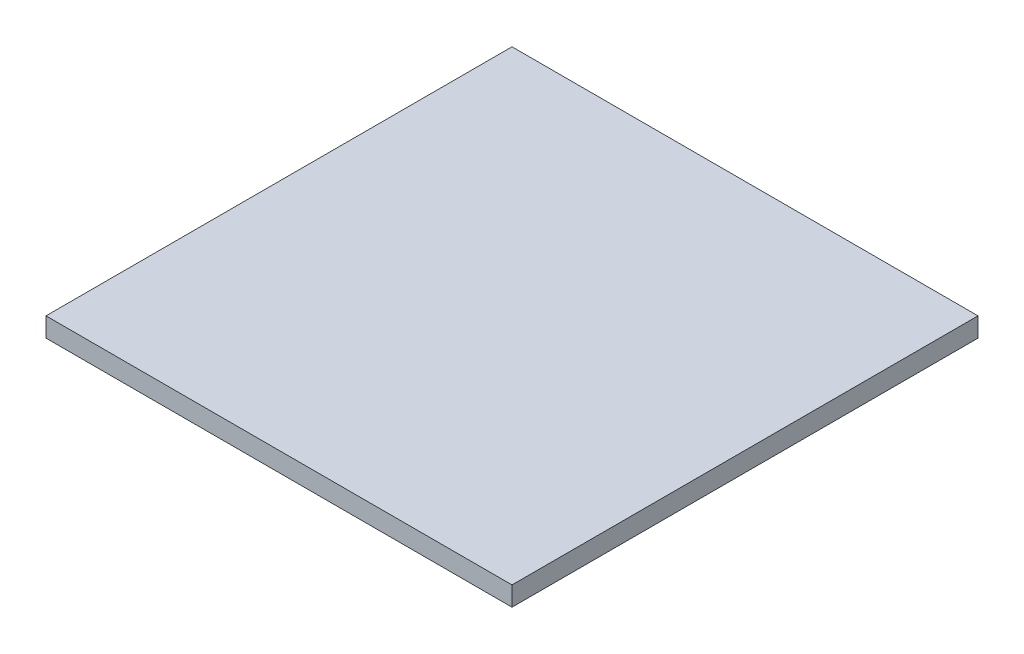
ISO-10303-21;
HEADER;
FILE_DESCRIPTION(('STEP AP214'),'2;1');
FILE_NAME('part.step','',(''),(''),'','','');
FILE_SCHEMA(('AUTOMOTIVE_DESIGN { 1 0 10303 214 1 1 1 1 }'));
ENDSEC;
DATA;
#1=APPLICATION_CONTEXT('core data for automotive mechanical design processes');
#2=APPLICATION_PROTOCOL_DEFINITION('international standard','automotive_design',2000,#1);
#3=PRODUCT_CONTEXT('',#1,'mechanical');
#4=PRODUCT('Part','Part','',(#3));
#5=PRODUCT_RELATED_PRODUCT_CATEGORY('part','',(#4));
#6=PRODUCT_DEFINITION_FORMATION('','',#4);
#7=PRODUCT_DEFINITION_CONTEXT('part definition',#1,'design');
#8=PRODUCT_DEFINITION('design','',#6,#7);
#9=PRODUCT_DEFINITION_SHAPE('','',#8);
#10=(LENGTH_UNIT() NAMED_UNIT(*) SI_UNIT(.MILLI.,.METRE.));
#11=(NAMED_UNIT(*) PLANE_ANGLE_UNIT() SI_UNIT($,.RADIAN.));
#12=(NAMED_UNIT(*) SI_UNIT($,.STERADIAN.) SOLID_ANGLE_UNIT());
#13=UNCERTAINTY_MEASURE_WITH_UNIT(LENGTH_MEASURE(1.E-05),#10,'distance_accuracy_value','');
#14=(GEOMETRIC_REPRESENTATION_CONTEXT(3) GLOBAL_UNCERTAINTY_ASSIGNED_CONTEXT((#13)) GLOBAL_UNIT_ASSIGNED_CONTEXT((#10,
#11,#12)) REPRESENTATION_CONTEXT('',''));
#15=CARTESIAN_POINT('',(0.,0.,0.));
#16=DIRECTION('',(0.,0.,1.));
#17=DIRECTION('',(1.,0.,0.));
#18=AXIS2_PLACEMENT_3D('',#15,#16,#17);
#19=CARTESIAN_POINT('',(0.,0.,1219.2));
#20=DIRECTION('',(1.,0.,0.));
#21=DIRECTION('',(0.,0.,-1.));
#22=AXIS2_PLACEMENT_3D('',#19,#20,#21);
#23=PLANE('',#22);
#24=DIRECTION('',(0.,-1.,0.));
#25=VECTOR('',#24,1.);
#26=CARTESIAN_POINT('',(0.,0.,0.));
#27=LINE('',#26,#25);
#28=CARTESIAN_POINT('',(0.,50.5658986175115,0.));
#29=VERTEX_POINT('',#28);
#30=CARTESIAN_POINT('',(0.,0.,0.));
#31=VERTEX_POINT('',#30);
#32=EDGE_CURVE('E96',#29,#31,#27,.T.);
#33=ORIENTED_EDGE('',*,*,#32,.T.);
#34=DIRECTION('',(0.,0.,-1.));
#35=VECTOR('',#34,1.);
#36=CARTESIAN_POINT('',(0.,0.,1219.2));
#37=LINE('',#36,#35);
#38=CARTESIAN_POINT('',(0.,0.,1219.2));
#39=VERTEX_POINT('',#38);
#40=EDGE_CURVE('E11',#39,#31,#37,.T.);
#41=ORIENTED_EDGE('',*,*,#40,.F.);
#42=DIRECTION('',(0.,-1.,0.));
#43=VECTOR('',#42,1.);
#44=CARTESIAN_POINT('',(0.,0.,1219.2));
#45=LINE('',#44,#43);
#46=CARTESIAN_POINT('',(0.,50.5658986175115,1219.2));
#47=VERTEX_POINT('',#46);
#48=EDGE_CURVE('E84',#47,#39,#45,.T.);
#49=ORIENTED_EDGE('',*,*,#48,.F.);
#50=DIRECTION('',(0.,0.,-1.));
#51=VECTOR('',#50,1.);
#52=CARTESIAN_POINT('',(0.,50.5658986175115,1219.2));
#53=LINE('',#52,#51);
#54=EDGE_CURVE('E92',#47,#29,#53,.T.);
#55=ORIENTED_EDGE('',*,*,#54,.T.);
#56=EDGE_LOOP('',(#33,#41,#49,#55));
#57=FACE_BOUND('',#56,.T.);
#58=ADVANCED_FACE('F33',(#57),#23,.F.);
#59=CARTESIAN_POINT('',(0.,0.,1219.2));
#60=DIRECTION('',(0.,1.,0.));
#61=DIRECTION('',(0.,0.,1.));
#62=AXIS2_PLACEMENT_3D('',#59,#60,#61);
#63=PLANE('',#62);
#64=DIRECTION('',(1.,0.,0.));
#65=VECTOR('',#64,1.);
#66=CARTESIAN_POINT('',(0.,0.,0.));
#67=LINE('',#66,#65);
#68=CARTESIAN_POINT('',(1219.2,0.,0.));
#69=VERTEX_POINT('',#68);
#70=EDGE_CURVE('E88',#31,#69,#67,.T.);
#71=ORIENTED_EDGE('',*,*,#70,.T.);
#72=DIRECTION('',(0.,0.,-1.));
#73=VECTOR('',#72,1.);
#74=CARTESIAN_POINT('',(1219.2,0.,1219.2));
#75=LINE('',#74,#73);
#76=CARTESIAN_POINT('',(1219.2,0.,1219.2));
#77=VERTEX_POINT('',#76);
#78=EDGE_CURVE('E41',#77,#69,#75,.T.);
#79=ORIENTED_EDGE('',*,*,#78,.F.);
#80=DIRECTION('',(1.,0.,0.));
#81=VECTOR('',#80,1.);
#82=CARTESIAN_POINT('',(0.,0.,1219.2));
#83=LINE('',#82,#81);
#84=EDGE_CURVE('E79',#39,#77,#83,.T.);
#85=ORIENTED_EDGE('',*,*,#84,.F.);
#86=ORIENTED_EDGE('',*,*,#40,.T.);
#87=EDGE_LOOP('',(#71,#79,#85,#86));
#88=FACE_BOUND('',#87,.T.);
#89=ADVANCED_FACE('F87',(#88),#63,.F.);
#90=CARTESIAN_POINT('',(1219.2,0.,1219.2));
#91=DIRECTION('',(-1.,0.,0.));
#92=DIRECTION('',(0.,0.,1.));
#93=AXIS2_PLACEMENT_3D('',#90,#91,#92);
#94=PLANE('',#93);
#95=DIRECTION('',(0.,1.,0.));
#96=VECTOR('',#95,1.);
#97=CARTESIAN_POINT('',(1219.2,0.,0.));
#98=LINE('',#97,#96);
#99=CARTESIAN_POINT('',(1219.2,50.5658986175115,0.));
#100=VERTEX_POINT('',#99);
#101=EDGE_CURVE('E66',#69,#100,#98,.T.);
#102=ORIENTED_EDGE('',*,*,#101,.T.);
#103=DIRECTION('',(0.,0.,-1.));
#104=VECTOR('',#103,1.);
#105=CARTESIAN_POINT('',(1219.2,50.5658986175115,1219.2));
#106=LINE('',#105,#104);
#107=CARTESIAN_POINT('',(1219.2,50.5658986175115,1219.2));
#108=VERTEX_POINT('',#107);
#109=EDGE_CURVE('E89',#108,#100,#106,.T.);
#110=ORIENTED_EDGE('',*,*,#109,.F.);
#111=DIRECTION('',(0.,1.,0.));
#112=VECTOR('',#111,1.);
#113=CARTESIAN_POINT('',(1219.2,0.,1219.2));
#114=LINE('',#113,#112);
#115=EDGE_CURVE('E82',#77,#108,#114,.T.);
#116=ORIENTED_EDGE('',*,*,#115,.F.);
#117=ORIENTED_EDGE('',*,*,#78,.T.);
#118=EDGE_LOOP('',(#102,#110,#116,#117));
#119=FACE_BOUND('',#118,.T.);
#120=ADVANCED_FACE('F90',(#119),#94,.F.);
#121=CARTESIAN_POINT('',(0.,50.5658986175115,1219.2));
#122=DIRECTION('',(0.,-1.,0.));
#123=DIRECTION('',(0.,0.,-1.));
#124=AXIS2_PLACEMENT_3D('',#121,#122,#123);
#125=PLANE('',#124);
#126=DIRECTION('',(-1.,0.,0.));
#127=VECTOR('',#126,1.);
#128=CARTESIAN_POINT('',(0.,50.5658986175115,0.));
#129=LINE('',#128,#127);
#130=EDGE_CURVE('E72',#100,#29,#129,.T.);
#131=ORIENTED_EDGE('',*,*,#130,.T.);
#132=ORIENTED_EDGE('',*,*,#54,.F.);
#133=DIRECTION('',(-1.,0.,0.));
#134=VECTOR('',#133,1.);
#135=CARTESIAN_POINT('',(0.,50.5658986175115,1219.2));
#136=LINE('',#135,#134);
#137=EDGE_CURVE('E49',#108,#47,#136,.T.);
#138=ORIENTED_EDGE('',*,*,#137,.F.);
#139=ORIENTED_EDGE('',*,*,#109,.T.);
#140=EDGE_LOOP('',(#131,#132,#138,#139));
#141=FACE_BOUND('',#140,.T.);
#142=ADVANCED_FACE('F103',(#141),#125,.F.);
#143=CARTESIAN_POINT('',(0.,0.,1219.2));
#144=DIRECTION('',(0.,0.,-1.));
#145=DIRECTION('',(-1.,0.,0.));
#146=AXIS2_PLACEMENT_3D('',#143,#144,#145);
#147=PLANE('',#146);
#148=ORIENTED_EDGE('',*,*,#48,.T.);
#149=ORIENTED_EDGE('',*,*,#84,.T.);
#150=ORIENTED_EDGE('',*,*,#115,.T.);
#151=ORIENTED_EDGE('',*,*,#137,.T.);
#152=EDGE_LOOP('',(#148,#149,#150,#151));
#153=FACE_BOUND('',#152,.T.);
#154=ADVANCED_FACE('F80',(#153),#147,.F.);
#155=CARTESIAN_POINT('',(0.,0.,0.));
#156=DIRECTION('',(0.,0.,-1.));
#157=DIRECTION('',(-1.,0.,0.));
#158=AXIS2_PLACEMENT_3D('',#155,#156,#157);
#159=PLANE('',#158);
#160=ORIENTED_EDGE('',*,*,#32,.F.);
#161=ORIENTED_EDGE('',*,*,#130,.F.);
#162=ORIENTED_EDGE('',*,*,#101,.F.);
#163=ORIENTED_EDGE('',*,*,#70,.F.);
#164=EDGE_LOOP('',(#160,#161,#162,#163));
#165=FACE_BOUND('',#164,.T.);
#166=ADVANCED_FACE('F106',(#165),#159,.T.);
#167=CLOSED_SHELL('',(#58,#89,#120,#142,#154,#166));
#168=MANIFOLD_SOLID_BREP('B2',#167);
#169=ADVANCED_BREP_SHAPE_REPRESENTATION('',(#18,#168),#14);
#170=SHAPE_DEFINITION_REPRESENTATION(#9,#169);
ENDSEC;
END-ISO-10303-21;
